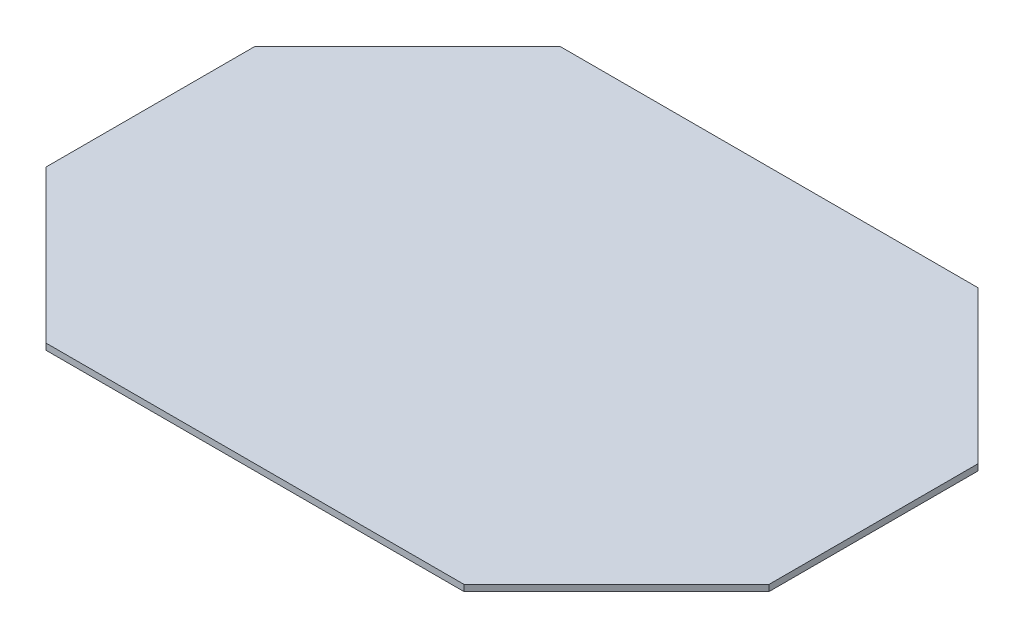
ISO-10303-21;
HEADER;
FILE_DESCRIPTION(('STEP AP214'),'2;1');
FILE_NAME('part.step','',(''),(''),'','','');
FILE_SCHEMA(('AUTOMOTIVE_DESIGN { 1 0 10303 214 1 1 1 1 }'));
ENDSEC;
DATA;
#1=APPLICATION_CONTEXT('core data for automotive mechanical design processes');
#2=APPLICATION_PROTOCOL_DEFINITION('international standard','automotive_design',2000,#1);
#3=PRODUCT_CONTEXT('',#1,'mechanical');
#4=PRODUCT('Part','Part','',(#3));
#5=PRODUCT_RELATED_PRODUCT_CATEGORY('part','',(#4));
#6=PRODUCT_DEFINITION_FORMATION('','',#4);
#7=PRODUCT_DEFINITION_CONTEXT('part definition',#1,'design');
#8=PRODUCT_DEFINITION('design','',#6,#7);
#9=PRODUCT_DEFINITION_SHAPE('','',#8);
#10=(LENGTH_UNIT() NAMED_UNIT(*) SI_UNIT(.MILLI.,.METRE.));
#11=(NAMED_UNIT(*) PLANE_ANGLE_UNIT() SI_UNIT($,.RADIAN.));
#12=(NAMED_UNIT(*) SI_UNIT($,.STERADIAN.) SOLID_ANGLE_UNIT());
#13=UNCERTAINTY_MEASURE_WITH_UNIT(LENGTH_MEASURE(1.E-05),#10,'distance_accuracy_value','');
#14=(GEOMETRIC_REPRESENTATION_CONTEXT(3) GLOBAL_UNCERTAINTY_ASSIGNED_CONTEXT((#13)) GLOBAL_UNIT_ASSIGNED_CONTEXT((#10,
#11,#12)) REPRESENTATION_CONTEXT('',''));
#15=CARTESIAN_POINT('',(0.,0.,0.));
#16=DIRECTION('',(0.,0.,1.));
#17=DIRECTION('',(1.,0.,0.));
#18=AXIS2_PLACEMENT_3D('',#15,#16,#17);
#19=CARTESIAN_POINT('',(72.9166666666724,3.,72.9166666666724));
#20=DIRECTION('',(0.707106781186547,0.,-0.707106781186548));
#21=DIRECTION('',(-0.707106781186548,0.,-0.707106781186547));
#22=AXIS2_PLACEMENT_3D('',#19,#20,#21);
#23=PLANE('',#22);
#24=DIRECTION('',(0.707106781186548,0.,0.707106781186547));
#25=VECTOR('',#24,1.);
#26=CARTESIAN_POINT('',(72.9166666666724,0.,72.9166666666724));
#27=LINE('',#26,#25);
#28=CARTESIAN_POINT('',(0.,0.,0.));
#29=VERTEX_POINT('',#28);
#30=CARTESIAN_POINT('',(72.9166666666724,0.,72.9166666666724));
#31=VERTEX_POINT('',#30);
#32=EDGE_CURVE('E127',#29,#31,#27,.T.);
#33=ORIENTED_EDGE('',*,*,#32,.T.);
#34=DIRECTION('',(0.,-1.,0.));
#35=VECTOR('',#34,1.);
#36=CARTESIAN_POINT('',(72.9166666666724,3.,72.9166666666724));
#37=LINE('',#36,#35);
#38=CARTESIAN_POINT('',(72.9166666666724,3.,72.9166666666724));
#39=VERTEX_POINT('',#38);
#40=EDGE_CURVE('E11',#39,#31,#37,.T.);
#41=ORIENTED_EDGE('',*,*,#40,.F.);
#42=DIRECTION('',(0.707106781186548,0.,0.707106781186547));
#43=VECTOR('',#42,1.);
#44=CARTESIAN_POINT('',(72.9166666666724,3.,72.9166666666724));
#45=LINE('',#44,#43);
#46=CARTESIAN_POINT('',(0.,3.,0.));
#47=VERTEX_POINT('',#46);
#48=EDGE_CURVE('E141',#47,#39,#45,.T.);
#49=ORIENTED_EDGE('',*,*,#48,.F.);
#50=DIRECTION('',(0.,-1.,0.));
#51=VECTOR('',#50,1.);
#52=CARTESIAN_POINT('',(0.,3.,0.));
#53=LINE('',#52,#51);
#54=EDGE_CURVE('E123',#47,#29,#53,.T.);
#55=ORIENTED_EDGE('',*,*,#54,.T.);
#56=EDGE_LOOP('',(#33,#41,#49,#55));
#57=FACE_BOUND('',#56,.T.);
#58=ADVANCED_FACE('F31',(#57),#23,.F.);
#59=CARTESIAN_POINT('',(272.916666666672,3.,72.9166666666724));
#60=DIRECTION('',(0.,0.,-1.));
#61=DIRECTION('',(-1.,0.,0.));
#62=AXIS2_PLACEMENT_3D('',#59,#60,#61);
#63=PLANE('',#62);
#64=DIRECTION('',(1.,0.,0.));
#65=VECTOR('',#64,1.);
#66=CARTESIAN_POINT('',(272.916666666672,0.,72.9166666666724));
#67=LINE('',#66,#65);
#68=CARTESIAN_POINT('',(272.916666666672,0.,72.9166666666724));
#69=VERTEX_POINT('',#68);
#70=EDGE_CURVE('E130',#31,#69,#67,.T.);
#71=ORIENTED_EDGE('',*,*,#70,.T.);
#72=DIRECTION('',(0.,-1.,0.));
#73=VECTOR('',#72,1.);
#74=CARTESIAN_POINT('',(272.916666666672,3.,72.9166666666724));
#75=LINE('',#74,#73);
#76=CARTESIAN_POINT('',(272.916666666672,3.,72.9166666666724));
#77=VERTEX_POINT('',#76);
#78=EDGE_CURVE('E39',#77,#69,#75,.T.);
#79=ORIENTED_EDGE('',*,*,#78,.F.);
#80=DIRECTION('',(1.,0.,0.));
#81=VECTOR('',#80,1.);
#82=CARTESIAN_POINT('',(272.916666666672,3.,72.9166666666724));
#83=LINE('',#82,#81);
#84=EDGE_CURVE('E90',#39,#77,#83,.T.);
#85=ORIENTED_EDGE('',*,*,#84,.F.);
#86=ORIENTED_EDGE('',*,*,#40,.T.);
#87=EDGE_LOOP('',(#71,#79,#85,#86));
#88=FACE_BOUND('',#87,.T.);
#89=ADVANCED_FACE('F176',(#88),#63,.F.);
#90=CARTESIAN_POINT('',(345.833333333345,3.,0.));
#91=DIRECTION('',(-0.707106781186547,0.,-0.707106781186548));
#92=DIRECTION('',(-0.707106781186548,0.,0.707106781186547));
#93=AXIS2_PLACEMENT_3D('',#90,#91,#92);
#94=PLANE('',#93);
#95=DIRECTION('',(0.707106781186548,0.,-0.707106781186547));
#96=VECTOR('',#95,1.);
#97=CARTESIAN_POINT('',(345.833333333345,0.,0.));
#98=LINE('',#97,#96);
#99=CARTESIAN_POINT('',(345.833333333345,0.,0.));
#100=VERTEX_POINT('',#99);
#101=EDGE_CURVE('E132',#69,#100,#98,.T.);
#102=ORIENTED_EDGE('',*,*,#101,.T.);
#103=DIRECTION('',(0.,-1.,0.));
#104=VECTOR('',#103,1.);
#105=CARTESIAN_POINT('',(345.833333333345,3.,0.));
#106=LINE('',#105,#104);
#107=CARTESIAN_POINT('',(345.833333333345,3.,0.));
#108=VERTEX_POINT('',#107);
#109=EDGE_CURVE('E148',#108,#100,#106,.T.);
#110=ORIENTED_EDGE('',*,*,#109,.F.);
#111=DIRECTION('',(0.707106781186548,0.,-0.707106781186547));
#112=VECTOR('',#111,1.);
#113=CARTESIAN_POINT('',(345.833333333345,3.,0.));
#114=LINE('',#113,#112);
#115=EDGE_CURVE('E156',#77,#108,#114,.T.);
#116=ORIENTED_EDGE('',*,*,#115,.F.);
#117=ORIENTED_EDGE('',*,*,#78,.T.);
#118=EDGE_LOOP('',(#102,#110,#116,#117));
#119=FACE_BOUND('',#118,.T.);
#120=ADVANCED_FACE('F154',(#119),#94,.F.);
#121=CARTESIAN_POINT('',(345.833333333345,3.,-100.));
#122=DIRECTION('',(-1.,0.,0.));
#123=DIRECTION('',(0.,0.,1.));
#124=AXIS2_PLACEMENT_3D('',#121,#122,#123);
#125=PLANE('',#124);
#126=DIRECTION('',(0.,0.,-1.));
#127=VECTOR('',#126,1.);
#128=CARTESIAN_POINT('',(345.833333333345,0.,-100.));
#129=LINE('',#128,#127);
#130=CARTESIAN_POINT('',(345.833333333345,0.,-100.));
#131=VERTEX_POINT('',#130);
#132=EDGE_CURVE('E134',#100,#131,#129,.T.);
#133=ORIENTED_EDGE('',*,*,#132,.T.);
#134=DIRECTION('',(0.,-1.,0.));
#135=VECTOR('',#134,1.);
#136=CARTESIAN_POINT('',(345.833333333345,3.,-100.));
#137=LINE('',#136,#135);
#138=CARTESIAN_POINT('',(345.833333333345,3.,-100.));
#139=VERTEX_POINT('',#138);
#140=EDGE_CURVE('E145',#139,#131,#137,.T.);
#141=ORIENTED_EDGE('',*,*,#140,.F.);
#142=DIRECTION('',(0.,0.,-1.));
#143=VECTOR('',#142,1.);
#144=CARTESIAN_POINT('',(345.833333333345,3.,-100.));
#145=LINE('',#144,#143);
#146=EDGE_CURVE('E168',#108,#139,#145,.T.);
#147=ORIENTED_EDGE('',*,*,#146,.F.);
#148=ORIENTED_EDGE('',*,*,#109,.T.);
#149=EDGE_LOOP('',(#133,#141,#147,#148));
#150=FACE_BOUND('',#149,.T.);
#151=ADVANCED_FACE('F164',(#150),#125,.F.);
#152=CARTESIAN_POINT('',(272.916666666672,3.,-172.916666666672));
#153=DIRECTION('',(-0.707106781186548,0.,0.707106781186547));
#154=DIRECTION('',(0.707106781186547,0.,0.707106781186548));
#155=AXIS2_PLACEMENT_3D('',#152,#153,#154);
#156=PLANE('',#155);
#157=DIRECTION('',(-0.707106781186548,0.,-0.707106781186548));
#158=VECTOR('',#157,1.);
#159=CARTESIAN_POINT('',(272.916666666672,0.,-172.916666666672));
#160=LINE('',#159,#158);
#161=CARTESIAN_POINT('',(272.916666666672,0.,-172.916666666672));
#162=VERTEX_POINT('',#161);
#163=EDGE_CURVE('E136',#131,#162,#160,.T.);
#164=ORIENTED_EDGE('',*,*,#163,.T.);
#165=DIRECTION('',(0.,-1.,0.));
#166=VECTOR('',#165,1.);
#167=CARTESIAN_POINT('',(272.916666666672,3.,-172.916666666672));
#168=LINE('',#167,#166);
#169=CARTESIAN_POINT('',(272.916666666672,3.,-172.916666666672));
#170=VERTEX_POINT('',#169);
#171=EDGE_CURVE('E118',#170,#162,#168,.T.);
#172=ORIENTED_EDGE('',*,*,#171,.F.);
#173=DIRECTION('',(-0.707106781186548,0.,-0.707106781186548));
#174=VECTOR('',#173,1.);
#175=CARTESIAN_POINT('',(272.916666666672,3.,-172.916666666672));
#176=LINE('',#175,#174);
#177=EDGE_CURVE('E109',#139,#170,#176,.T.);
#178=ORIENTED_EDGE('',*,*,#177,.F.);
#179=ORIENTED_EDGE('',*,*,#140,.T.);
#180=EDGE_LOOP('',(#164,#172,#178,#179));
#181=FACE_BOUND('',#180,.T.);
#182=ADVANCED_FACE('F167',(#181),#156,.F.);
#183=CARTESIAN_POINT('',(72.9166666666725,3.,-172.916666666672));
#184=DIRECTION('',(0.,0.,1.));
#185=DIRECTION('',(1.,0.,0.));
#186=AXIS2_PLACEMENT_3D('',#183,#184,#185);
#187=PLANE('',#186);
#188=DIRECTION('',(-1.,0.,0.));
#189=VECTOR('',#188,1.);
#190=CARTESIAN_POINT('',(72.9166666666725,0.,-172.916666666672));
#191=LINE('',#190,#189);
#192=CARTESIAN_POINT('',(72.9166666666725,0.,-172.916666666672));
#193=VERTEX_POINT('',#192);
#194=EDGE_CURVE('E117',#162,#193,#191,.T.);
#195=ORIENTED_EDGE('',*,*,#194,.T.);
#196=DIRECTION('',(0.,-1.,0.));
#197=VECTOR('',#196,1.);
#198=CARTESIAN_POINT('',(72.9166666666725,3.,-172.916666666672));
#199=LINE('',#198,#197);
#200=CARTESIAN_POINT('',(72.9166666666725,3.,-172.916666666672));
#201=VERTEX_POINT('',#200);
#202=EDGE_CURVE('E114',#201,#193,#199,.T.);
#203=ORIENTED_EDGE('',*,*,#202,.F.);
#204=DIRECTION('',(-1.,0.,0.));
#205=VECTOR('',#204,1.);
#206=CARTESIAN_POINT('',(72.9166666666725,3.,-172.916666666672));
#207=LINE('',#206,#205);
#208=EDGE_CURVE('E103',#170,#201,#207,.T.);
#209=ORIENTED_EDGE('',*,*,#208,.F.);
#210=ORIENTED_EDGE('',*,*,#171,.T.);
#211=EDGE_LOOP('',(#195,#203,#209,#210));
#212=FACE_BOUND('',#211,.T.);
#213=ADVANCED_FACE('F115',(#212),#187,.F.);
#214=CARTESIAN_POINT('',(0.,3.,-100.));
#215=DIRECTION('',(0.707106781186547,0.,0.707106781186548));
#216=DIRECTION('',(0.707106781186548,0.,-0.707106781186547));
#217=AXIS2_PLACEMENT_3D('',#214,#215,#216);
#218=PLANE('',#217);
#219=DIRECTION('',(-0.707106781186548,0.,0.707106781186548));
#220=VECTOR('',#219,1.);
#221=CARTESIAN_POINT('',(0.,0.,-100.));
#222=LINE('',#221,#220);
#223=CARTESIAN_POINT('',(0.,0.,-100.));
#224=VERTEX_POINT('',#223);
#225=EDGE_CURVE('E76',#193,#224,#222,.T.);
#226=ORIENTED_EDGE('',*,*,#225,.T.);
#227=DIRECTION('',(0.,-1.,0.));
#228=VECTOR('',#227,1.);
#229=CARTESIAN_POINT('',(0.,3.,-100.));
#230=LINE('',#229,#228);
#231=CARTESIAN_POINT('',(0.,3.,-100.));
#232=VERTEX_POINT('',#231);
#233=EDGE_CURVE('E119',#232,#224,#230,.T.);
#234=ORIENTED_EDGE('',*,*,#233,.F.);
#235=DIRECTION('',(-0.707106781186548,0.,0.707106781186548));
#236=VECTOR('',#235,1.);
#237=CARTESIAN_POINT('',(0.,3.,-100.));
#238=LINE('',#237,#236);
#239=EDGE_CURVE('E107',#201,#232,#238,.T.);
#240=ORIENTED_EDGE('',*,*,#239,.F.);
#241=ORIENTED_EDGE('',*,*,#202,.T.);
#242=EDGE_LOOP('',(#226,#234,#240,#241));
#243=FACE_BOUND('',#242,.T.);
#244=ADVANCED_FACE('F121',(#243),#218,.F.);
#245=CARTESIAN_POINT('',(0.,3.,0.));
#246=DIRECTION('',(1.,0.,0.));
#247=DIRECTION('',(0.,0.,-1.));
#248=AXIS2_PLACEMENT_3D('',#245,#246,#247);
#249=PLANE('',#248);
#250=DIRECTION('',(0.,0.,1.));
#251=VECTOR('',#250,1.);
#252=CARTESIAN_POINT('',(0.,0.,0.));
#253=LINE('',#252,#251);
#254=EDGE_CURVE('E82',#224,#29,#253,.T.);
#255=ORIENTED_EDGE('',*,*,#254,.T.);
#256=ORIENTED_EDGE('',*,*,#54,.F.);
#257=DIRECTION('',(0.,0.,1.));
#258=VECTOR('',#257,1.);
#259=CARTESIAN_POINT('',(0.,3.,0.));
#260=LINE('',#259,#258);
#261=EDGE_CURVE('E47',#232,#47,#260,.T.);
#262=ORIENTED_EDGE('',*,*,#261,.F.);
#263=ORIENTED_EDGE('',*,*,#233,.T.);
#264=EDGE_LOOP('',(#255,#256,#262,#263));
#265=FACE_BOUND('',#264,.T.);
#266=ADVANCED_FACE('F192',(#265),#249,.F.);
#267=CARTESIAN_POINT('',(-50.,3.,-50.));
#268=DIRECTION('',(0.,-1.,0.));
#269=DIRECTION('',(0.,0.,-1.));
#270=AXIS2_PLACEMENT_3D('',#267,#268,#269);
#271=PLANE('',#270);
#272=ORIENTED_EDGE('',*,*,#48,.T.);
#273=ORIENTED_EDGE('',*,*,#84,.T.);
#274=ORIENTED_EDGE('',*,*,#115,.T.);
#275=ORIENTED_EDGE('',*,*,#146,.T.);
#276=ORIENTED_EDGE('',*,*,#177,.T.);
#277=ORIENTED_EDGE('',*,*,#208,.T.);
#278=ORIENTED_EDGE('',*,*,#239,.T.);
#279=ORIENTED_EDGE('',*,*,#261,.T.);
#280=EDGE_LOOP('',(#272,#273,#274,#275,#276,#277,#278,#279));
#281=FACE_BOUND('',#280,.T.);
#282=ADVANCED_FACE('F105',(#281),#271,.F.);
#283=CARTESIAN_POINT('',(-50.,0.,-50.));
#284=DIRECTION('',(0.,-1.,0.));
#285=DIRECTION('',(0.,0.,-1.));
#286=AXIS2_PLACEMENT_3D('',#283,#284,#285);
#287=PLANE('',#286);
#288=ORIENTED_EDGE('',*,*,#32,.F.);
#289=ORIENTED_EDGE('',*,*,#254,.F.);
#290=ORIENTED_EDGE('',*,*,#225,.F.);
#291=ORIENTED_EDGE('',*,*,#194,.F.);
#292=ORIENTED_EDGE('',*,*,#163,.F.);
#293=ORIENTED_EDGE('',*,*,#132,.F.);
#294=ORIENTED_EDGE('',*,*,#101,.F.);
#295=ORIENTED_EDGE('',*,*,#70,.F.);
#296=EDGE_LOOP('',(#288,#289,#290,#291,#292,#293,#294,#295));
#297=FACE_BOUND('',#296,.T.);
#298=ADVANCED_FACE('F160',(#297),#287,.T.);
#299=CLOSED_SHELL('',(#58,#89,#120,#151,#182,#213,#244,#266,#282,#298));
#300=MANIFOLD_SOLID_BREP('B2',#299);
#301=ADVANCED_BREP_SHAPE_REPRESENTATION('',(#18,#300),#14);
#302=SHAPE_DEFINITION_REPRESENTATION(#9,#301);
ENDSEC;
END-ISO-10303-21;
